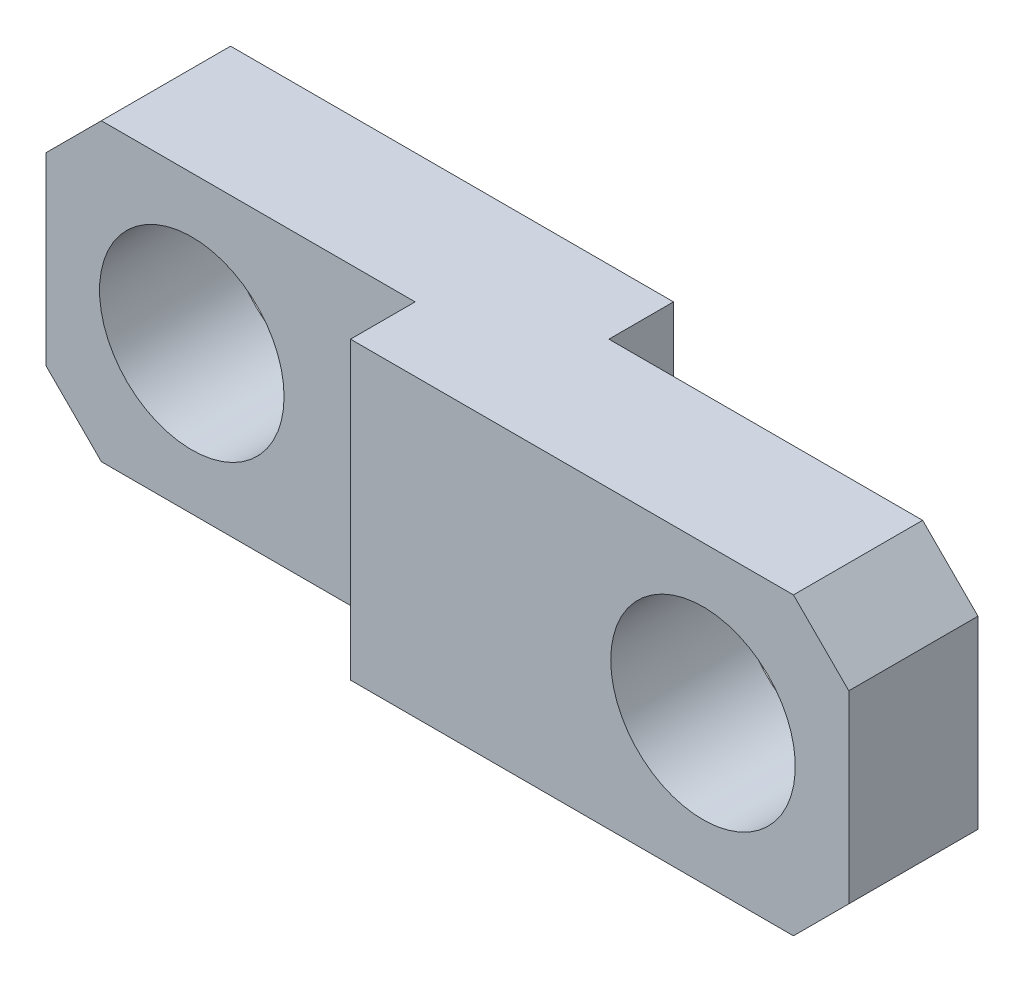
ISO-10303-21;
HEADER;
FILE_DESCRIPTION(('STEP AP214'),'2;1');
FILE_NAME('part.step','',(''),(''),'','','');
FILE_SCHEMA(('AUTOMOTIVE_DESIGN { 1 0 10303 214 1 1 1 1 }'));
ENDSEC;
DATA;
#1=APPLICATION_CONTEXT('core data for automotive mechanical design processes');
#2=APPLICATION_PROTOCOL_DEFINITION('international standard','automotive_design',2000,#1);
#3=PRODUCT_CONTEXT('',#1,'mechanical');
#4=PRODUCT('Part','Part','',(#3));
#5=PRODUCT_RELATED_PRODUCT_CATEGORY('part','',(#4));
#6=PRODUCT_DEFINITION_FORMATION('','',#4);
#7=PRODUCT_DEFINITION_CONTEXT('part definition',#1,'design');
#8=PRODUCT_DEFINITION('design','',#6,#7);
#9=PRODUCT_DEFINITION_SHAPE('','',#8);
#10=(LENGTH_UNIT() NAMED_UNIT(*) SI_UNIT(.MILLI.,.METRE.));
#11=(NAMED_UNIT(*) PLANE_ANGLE_UNIT() SI_UNIT($,.RADIAN.));
#12=(NAMED_UNIT(*) SI_UNIT($,.STERADIAN.) SOLID_ANGLE_UNIT());
#13=UNCERTAINTY_MEASURE_WITH_UNIT(LENGTH_MEASURE(1.E-05),#10,'distance_accuracy_value','');
#14=(GEOMETRIC_REPRESENTATION_CONTEXT(3) GLOBAL_UNCERTAINTY_ASSIGNED_CONTEXT((#13)) GLOBAL_UNIT_ASSIGNED_CONTEXT((#10,
#11,#12)) REPRESENTATION_CONTEXT('',''));
#15=CARTESIAN_POINT('',(0.,0.,0.));
#16=DIRECTION('',(0.,0.,1.));
#17=DIRECTION('',(1.,0.,0.));
#18=AXIS2_PLACEMENT_3D('',#15,#16,#17);
#19=CARTESIAN_POINT('',(19.55,4.,2.625));
#20=DIRECTION('',(-1.,0.,0.));
#21=DIRECTION('',(0.,-1.,0.));
#22=AXIS2_PLACEMENT_3D('',#19,#20,#21);
#23=PLANE('',#22);
#24=DIRECTION('',(0.,1.,0.));
#25=VECTOR('',#24,1.);
#26=CARTESIAN_POINT('',(19.55,4.,2.625));
#27=LINE('',#26,#25);
#28=CARTESIAN_POINT('',(19.55,-2.49999999999998,2.625));
#29=VERTEX_POINT('',#28);
#30=CARTESIAN_POINT('',(19.55,2.49999999999999,2.625));
#31=VERTEX_POINT('',#30);
#32=EDGE_CURVE('E203',#29,#31,#27,.T.);
#33=ORIENTED_EDGE('',*,*,#32,.F.);
#34=DIRECTION('',(0.,0.,-1.));
#35=VECTOR('',#34,1.);
#36=CARTESIAN_POINT('',(19.55,-2.49999999999999,2.625));
#37=LINE('',#36,#35);
#38=CARTESIAN_POINT('',(19.55,-2.49999999999999,-0.875));
#39=VERTEX_POINT('',#38);
#40=EDGE_CURVE('E214',#29,#39,#37,.T.);
#41=ORIENTED_EDGE('',*,*,#40,.T.);
#42=DIRECTION('',(0.,-1.,0.));
#43=VECTOR('',#42,1.);
#44=CARTESIAN_POINT('',(19.55,4.,-0.875));
#45=LINE('',#44,#43);
#46=CARTESIAN_POINT('',(19.55,2.49999999999999,-0.875));
#47=VERTEX_POINT('',#46);
#48=EDGE_CURVE('E160',#47,#39,#45,.T.);
#49=ORIENTED_EDGE('',*,*,#48,.F.);
#50=DIRECTION('',(0.,0.,1.));
#51=VECTOR('',#50,1.);
#52=CARTESIAN_POINT('',(19.55,2.49999999999999,2.625));
#53=LINE('',#52,#51);
#54=EDGE_CURVE('E208',#47,#31,#53,.T.);
#55=ORIENTED_EDGE('',*,*,#54,.T.);
#56=EDGE_LOOP('',(#33,#41,#49,#55));
#57=FACE_BOUND('',#56,.T.);
#58=ADVANCED_FACE('F32',(#57),#23,.F.);
#59=CARTESIAN_POINT('',(15.6,0.,2.625));
#60=DIRECTION('',(0.,0.,-1.));
#61=DIRECTION('',(-1.,0.,0.));
#62=AXIS2_PLACEMENT_3D('',#59,#60,#61);
#63=CYLINDRICAL_SURFACE('',#62,2.5);
#64=CARTESIAN_POINT('',(15.6,0.,2.625));
#65=DIRECTION('',(0.,0.,1.));
#66=DIRECTION('',(-1.,0.,0.));
#67=AXIS2_PLACEMENT_3D('',#64,#65,#66);
#68=CIRCLE('',#67,2.5);
#69=CARTESIAN_POINT('',(13.1,0.,2.625));
#70=VERTEX_POINT('',#69);
#71=EDGE_CURVE('E191',#70,#70,#68,.T.);
#72=ORIENTED_EDGE('',*,*,#71,.T.);
#73=EDGE_LOOP('',(#72));
#74=FACE_BOUND('',#73,.T.);
#75=CARTESIAN_POINT('',(15.6,0.,-0.875));
#76=DIRECTION('',(0.,0.,-1.));
#77=DIRECTION('',(-1.,0.,0.));
#78=AXIS2_PLACEMENT_3D('',#75,#76,#77);
#79=CIRCLE('',#78,2.5);
#80=CARTESIAN_POINT('',(13.1,0.,-0.875));
#81=VERTEX_POINT('',#80);
#82=EDGE_CURVE('E170',#81,#81,#79,.T.);
#83=ORIENTED_EDGE('',*,*,#82,.T.);
#84=EDGE_LOOP('',(#83));
#85=FACE_BOUND('',#84,.T.);
#86=ADVANCED_FACE('F293',(#74,#85),#63,.F.);
#87=CARTESIAN_POINT('',(-3.95,4.,2.625));
#88=DIRECTION('',(1.,0.,0.));
#89=DIRECTION('',(0.,0.,-1.));
#90=AXIS2_PLACEMENT_3D('',#87,#88,#89);
#91=PLANE('',#90);
#92=DIRECTION('',(0.,-1.,0.));
#93=VECTOR('',#92,1.);
#94=CARTESIAN_POINT('',(-3.95,4.,0.875));
#95=LINE('',#94,#93);
#96=CARTESIAN_POINT('',(-3.95,2.49999999999999,0.875));
#97=VERTEX_POINT('',#96);
#98=CARTESIAN_POINT('',(-3.95,-2.49999999999999,0.875));
#99=VERTEX_POINT('',#98);
#100=EDGE_CURVE('E182',#97,#99,#95,.T.);
#101=ORIENTED_EDGE('',*,*,#100,.F.);
#102=DIRECTION('',(0.,0.,-1.));
#103=VECTOR('',#102,1.);
#104=CARTESIAN_POINT('',(-3.95,2.49999999999999,2.625));
#105=LINE('',#104,#103);
#106=CARTESIAN_POINT('',(-3.95,2.49999999999999,-2.625));
#107=VERTEX_POINT('',#106);
#108=EDGE_CURVE('E235',#97,#107,#105,.T.);
#109=ORIENTED_EDGE('',*,*,#108,.T.);
#110=DIRECTION('',(0.,-1.,0.));
#111=VECTOR('',#110,1.);
#112=CARTESIAN_POINT('',(-3.95,4.,-2.625));
#113=LINE('',#112,#111);
#114=CARTESIAN_POINT('',(-3.95,-2.49999999999999,-2.625));
#115=VERTEX_POINT('',#114);
#116=EDGE_CURVE('E138',#107,#115,#113,.T.);
#117=ORIENTED_EDGE('',*,*,#116,.T.);
#118=DIRECTION('',(0.,0.,1.));
#119=VECTOR('',#118,1.);
#120=CARTESIAN_POINT('',(-3.95,-2.49999999999999,2.625));
#121=LINE('',#120,#119);
#122=EDGE_CURVE('E233',#115,#99,#121,.T.);
#123=ORIENTED_EDGE('',*,*,#122,.T.);
#124=EDGE_LOOP('',(#101,#109,#117,#123));
#125=FACE_BOUND('',#124,.T.);
#126=ADVANCED_FACE('F34',(#125),#91,.F.);
#127=CARTESIAN_POINT('',(0.,0.,2.625));
#128=DIRECTION('',(0.,0.,-1.));
#129=DIRECTION('',(-1.,0.,0.));
#130=AXIS2_PLACEMENT_3D('',#127,#128,#129);
#131=CYLINDRICAL_SURFACE('',#130,2.5);
#132=CARTESIAN_POINT('',(0.,0.,-2.625));
#133=DIRECTION('',(0.,0.,1.));
#134=DIRECTION('',(1.,0.,0.));
#135=AXIS2_PLACEMENT_3D('',#132,#133,#134);
#136=CIRCLE('',#135,2.5);
#137=CARTESIAN_POINT('',(2.5,0.,-2.625));
#138=VERTEX_POINT('',#137);
#139=EDGE_CURVE('E194',#138,#138,#136,.T.);
#140=ORIENTED_EDGE('',*,*,#139,.F.);
#141=EDGE_LOOP('',(#140));
#142=FACE_BOUND('',#141,.T.);
#143=CARTESIAN_POINT('',(0.,0.,0.875));
#144=DIRECTION('',(0.,0.,1.));
#145=DIRECTION('',(1.,0.,0.));
#146=AXIS2_PLACEMENT_3D('',#143,#144,#145);
#147=CIRCLE('',#146,2.5);
#148=CARTESIAN_POINT('',(2.5,0.,0.875));
#149=VERTEX_POINT('',#148);
#150=EDGE_CURVE('E189',#149,#149,#147,.T.);
#151=ORIENTED_EDGE('',*,*,#150,.T.);
#152=EDGE_LOOP('',(#151));
#153=FACE_BOUND('',#152,.T.);
#154=ADVANCED_FACE('F312',(#142,#153),#131,.F.);
#155=CARTESIAN_POINT('',(-3.95,-4.,2.625));
#156=DIRECTION('',(0.,0.,1.));
#157=DIRECTION('',(1.,0.,0.));
#158=AXIS2_PLACEMENT_3D('',#155,#156,#157);
#159=PLANE('',#158);
#160=DIRECTION('',(1.,0.,0.));
#161=VECTOR('',#160,1.);
#162=CARTESIAN_POINT('',(-3.95,-4.,2.625));
#163=LINE('',#162,#161);
#164=CARTESIAN_POINT('',(6.05,-4.,2.625));
#165=VERTEX_POINT('',#164);
#166=CARTESIAN_POINT('',(18.05,-4.,2.625));
#167=VERTEX_POINT('',#166);
#168=EDGE_CURVE('E200',#165,#167,#163,.T.);
#169=ORIENTED_EDGE('',*,*,#168,.T.);
#170=DIRECTION('',(-0.707106781186553,-0.707106781186542,0.));
#171=VECTOR('',#170,1.);
#172=CARTESIAN_POINT('',(7.04999999999982,-15.,2.625));
#173=LINE('',#172,#171);
#174=EDGE_CURVE('E226',#167,#29,#173,.F.);
#175=ORIENTED_EDGE('',*,*,#174,.T.);
#176=ORIENTED_EDGE('',*,*,#32,.T.);
#177=DIRECTION('',(0.707106781186552,-0.707106781186543,0.));
#178=VECTOR('',#177,1.);
#179=CARTESIAN_POINT('',(11.0499999999998,11.,2.625));
#180=LINE('',#179,#178);
#181=CARTESIAN_POINT('',(18.05,4.,2.625));
#182=VERTEX_POINT('',#181);
#183=EDGE_CURVE('E224',#31,#182,#180,.F.);
#184=ORIENTED_EDGE('',*,*,#183,.T.);
#185=DIRECTION('',(-1.,0.,0.));
#186=VECTOR('',#185,1.);
#187=CARTESIAN_POINT('',(-3.95,4.,2.625));
#188=LINE('',#187,#186);
#189=CARTESIAN_POINT('',(6.05,4.,2.625));
#190=VERTEX_POINT('',#189);
#191=EDGE_CURVE('E206',#182,#190,#188,.T.);
#192=ORIENTED_EDGE('',*,*,#191,.T.);
#193=DIRECTION('',(0.,1.,0.));
#194=VECTOR('',#193,1.);
#195=CARTESIAN_POINT('',(6.05,-4.,2.625));
#196=LINE('',#195,#194);
#197=EDGE_CURVE('E172',#165,#190,#196,.T.);
#198=ORIENTED_EDGE('',*,*,#197,.F.);
#199=EDGE_LOOP('',(#169,#175,#176,#184,#192,#198));
#200=FACE_BOUND('',#199,.T.);
#201=ORIENTED_EDGE('',*,*,#71,.F.);
#202=EDGE_LOOP('',(#201));
#203=FACE_BOUND('',#202,.T.);
#204=ADVANCED_FACE('F263',(#200,#203),#159,.T.);
#205=CARTESIAN_POINT('',(-3.95,-4.,-2.625));
#206=DIRECTION('',(0.,0.,1.));
#207=DIRECTION('',(1.,0.,0.));
#208=AXIS2_PLACEMENT_3D('',#205,#206,#207);
#209=PLANE('',#208);
#210=ORIENTED_EDGE('',*,*,#139,.T.);
#211=EDGE_LOOP('',(#210));
#212=FACE_BOUND('',#211,.T.);
#213=ORIENTED_EDGE('',*,*,#116,.F.);
#214=DIRECTION('',(-0.707106781186551,-0.707106781186544,0.));
#215=VECTOR('',#214,1.);
#216=CARTESIAN_POINT('',(-3.95,2.49999999999999,-2.625));
#217=LINE('',#216,#215);
#218=CARTESIAN_POINT('',(-2.44999999999998,4.,-2.625));
#219=VERTEX_POINT('',#218);
#220=EDGE_CURVE('E55',#107,#219,#217,.F.);
#221=ORIENTED_EDGE('',*,*,#220,.T.);
#222=DIRECTION('',(-1.,0.,0.));
#223=VECTOR('',#222,1.);
#224=CARTESIAN_POINT('',(-3.95,4.,-2.625));
#225=LINE('',#224,#223);
#226=CARTESIAN_POINT('',(9.55,4.,-2.625));
#227=VERTEX_POINT('',#226);
#228=EDGE_CURVE('E137',#227,#219,#225,.T.);
#229=ORIENTED_EDGE('',*,*,#228,.F.);
#230=DIRECTION('',(0.,1.,0.));
#231=VECTOR('',#230,1.);
#232=CARTESIAN_POINT('',(9.55,4.,-2.625));
#233=LINE('',#232,#231);
#234=CARTESIAN_POINT('',(9.55,-2.,-2.625));
#235=VERTEX_POINT('',#234);
#236=EDGE_CURVE('E153',#235,#227,#233,.T.);
#237=ORIENTED_EDGE('',*,*,#236,.F.);
#238=DIRECTION('',(0.866025403784441,0.499999999999995,0.));
#239=VECTOR('',#238,1.);
#240=CARTESIAN_POINT('',(9.55,-2.,-2.625));
#241=LINE('',#240,#239);
#242=CARTESIAN_POINT('',(6.0858983848622,-4.,-2.625));
#243=VERTEX_POINT('',#242);
#244=EDGE_CURVE('E144',#243,#235,#241,.T.);
#245=ORIENTED_EDGE('',*,*,#244,.F.);
#246=DIRECTION('',(1.,0.,0.));
#247=VECTOR('',#246,1.);
#248=CARTESIAN_POINT('',(-3.95,-4.,-2.625));
#249=LINE('',#248,#247);
#250=CARTESIAN_POINT('',(-2.44999999999998,-4.,-2.625));
#251=VERTEX_POINT('',#250);
#252=EDGE_CURVE('E128',#251,#243,#249,.T.);
#253=ORIENTED_EDGE('',*,*,#252,.F.);
#254=DIRECTION('',(0.707106781186551,-0.707106781186544,0.));
#255=VECTOR('',#254,1.);
#256=CARTESIAN_POINT('',(-2.44999999999998,-4.,-2.625));
#257=LINE('',#256,#255);
#258=EDGE_CURVE('E47',#251,#115,#257,.F.);
#259=ORIENTED_EDGE('',*,*,#258,.T.);
#260=EDGE_LOOP('',(#213,#221,#229,#237,#245,#253,#259));
#261=FACE_BOUND('',#260,.T.);
#262=ADVANCED_FACE('F151',(#212,#261),#209,.F.);
#263=CARTESIAN_POINT('',(-3.95,-4.,2.625));
#264=DIRECTION('',(0.,1.,0.));
#265=DIRECTION('',(-1.,0.,0.));
#266=AXIS2_PLACEMENT_3D('',#263,#264,#265);
#267=PLANE('',#266);
#268=DIRECTION('',(-1.,0.,0.));
#269=VECTOR('',#268,1.);
#270=CARTESIAN_POINT('',(19.55,-4.,-0.875));
#271=LINE('',#270,#269);
#272=CARTESIAN_POINT('',(18.05,-4.,-0.875));
#273=VERTEX_POINT('',#272);
#274=CARTESIAN_POINT('',(6.0858983848622,-4.,-0.875));
#275=VERTEX_POINT('',#274);
#276=EDGE_CURVE('E163',#273,#275,#271,.T.);
#277=ORIENTED_EDGE('',*,*,#276,.F.);
#278=DIRECTION('',(0.,0.,1.));
#279=VECTOR('',#278,1.);
#280=CARTESIAN_POINT('',(18.05,-4.,2.625));
#281=LINE('',#280,#279);
#282=EDGE_CURVE('E222',#273,#167,#281,.T.);
#283=ORIENTED_EDGE('',*,*,#282,.T.);
#284=ORIENTED_EDGE('',*,*,#168,.F.);
#285=DIRECTION('',(0.,0.,1.));
#286=VECTOR('',#285,1.);
#287=CARTESIAN_POINT('',(6.05,-4.,0.875));
#288=LINE('',#287,#286);
#289=CARTESIAN_POINT('',(6.05,-4.,0.875));
#290=VERTEX_POINT('',#289);
#291=EDGE_CURVE('E185',#290,#165,#288,.T.);
#292=ORIENTED_EDGE('',*,*,#291,.F.);
#293=DIRECTION('',(1.,0.,0.));
#294=VECTOR('',#293,1.);
#295=CARTESIAN_POINT('',(-3.95,-4.,0.875));
#296=LINE('',#295,#294);
#297=CARTESIAN_POINT('',(-2.44999999999998,-4.,0.875));
#298=VERTEX_POINT('',#297);
#299=EDGE_CURVE('E175',#298,#290,#296,.T.);
#300=ORIENTED_EDGE('',*,*,#299,.F.);
#301=DIRECTION('',(0.,0.,-1.));
#302=VECTOR('',#301,1.);
#303=CARTESIAN_POINT('',(-2.44999999999998,-4.,2.625));
#304=LINE('',#303,#302);
#305=EDGE_CURVE('E135',#298,#251,#304,.T.);
#306=ORIENTED_EDGE('',*,*,#305,.T.);
#307=ORIENTED_EDGE('',*,*,#252,.T.);
#308=DIRECTION('',(0.,0.,-1.));
#309=VECTOR('',#308,1.);
#310=CARTESIAN_POINT('',(6.0858983848622,-4.,-0.875));
#311=LINE('',#310,#309);
#312=EDGE_CURVE('E132',#275,#243,#311,.T.);
#313=ORIENTED_EDGE('',*,*,#312,.F.);
#314=EDGE_LOOP('',(#277,#283,#284,#292,#300,#306,#307,#313));
#315=FACE_BOUND('',#314,.T.);
#316=ADVANCED_FACE('F131',(#315),#267,.F.);
#317=CARTESIAN_POINT('',(-3.95,4.,2.625));
#318=DIRECTION('',(0.,-1.,0.));
#319=DIRECTION('',(1.,0.,0.));
#320=AXIS2_PLACEMENT_3D('',#317,#318,#319);
#321=PLANE('',#320);
#322=ORIENTED_EDGE('',*,*,#191,.F.);
#323=DIRECTION('',(0.,0.,-1.));
#324=VECTOR('',#323,1.);
#325=CARTESIAN_POINT('',(18.05,4.,2.625));
#326=LINE('',#325,#324);
#327=CARTESIAN_POINT('',(18.05,4.,-0.875));
#328=VERTEX_POINT('',#327);
#329=EDGE_CURVE('E230',#182,#328,#326,.T.);
#330=ORIENTED_EDGE('',*,*,#329,.T.);
#331=DIRECTION('',(1.,0.,0.));
#332=VECTOR('',#331,1.);
#333=CARTESIAN_POINT('',(9.55,4.,-0.875));
#334=LINE('',#333,#332);
#335=CARTESIAN_POINT('',(9.55,4.,-0.875));
#336=VERTEX_POINT('',#335);
#337=EDGE_CURVE('E155',#336,#328,#334,.T.);
#338=ORIENTED_EDGE('',*,*,#337,.F.);
#339=DIRECTION('',(0.,0.,-1.));
#340=VECTOR('',#339,1.);
#341=CARTESIAN_POINT('',(9.55,4.,-0.875));
#342=LINE('',#341,#340);
#343=EDGE_CURVE('E167',#336,#227,#342,.T.);
#344=ORIENTED_EDGE('',*,*,#343,.T.);
#345=ORIENTED_EDGE('',*,*,#228,.T.);
#346=DIRECTION('',(0.,0.,1.));
#347=VECTOR('',#346,1.);
#348=CARTESIAN_POINT('',(-2.44999999999998,4.,2.625));
#349=LINE('',#348,#347);
#350=CARTESIAN_POINT('',(-2.44999999999998,4.,0.875));
#351=VERTEX_POINT('',#350);
#352=EDGE_CURVE('E228',#219,#351,#349,.T.);
#353=ORIENTED_EDGE('',*,*,#352,.T.);
#354=DIRECTION('',(-1.,0.,0.));
#355=VECTOR('',#354,1.);
#356=CARTESIAN_POINT('',(6.05,4.,0.875));
#357=LINE('',#356,#355);
#358=CARTESIAN_POINT('',(6.05,4.,0.875));
#359=VERTEX_POINT('',#358);
#360=EDGE_CURVE('E179',#359,#351,#357,.T.);
#361=ORIENTED_EDGE('',*,*,#360,.F.);
#362=DIRECTION('',(0.,0.,1.));
#363=VECTOR('',#362,1.);
#364=CARTESIAN_POINT('',(6.05,4.,0.875));
#365=LINE('',#364,#363);
#366=EDGE_CURVE('E186',#359,#190,#365,.T.);
#367=ORIENTED_EDGE('',*,*,#366,.T.);
#368=EDGE_LOOP('',(#322,#330,#338,#344,#345,#353,#361,#367));
#369=FACE_BOUND('',#368,.T.);
#370=ADVANCED_FACE('F251',(#369),#321,.F.);
#371=CARTESIAN_POINT('',(6.05,-4.,0.875));
#372=DIRECTION('',(1.,0.,0.));
#373=DIRECTION('',(0.,0.,-1.));
#374=AXIS2_PLACEMENT_3D('',#371,#372,#373);
#375=PLANE('',#374);
#376=ORIENTED_EDGE('',*,*,#197,.T.);
#377=ORIENTED_EDGE('',*,*,#366,.F.);
#378=DIRECTION('',(0.,1.,0.));
#379=VECTOR('',#378,1.);
#380=CARTESIAN_POINT('',(6.05,-4.,0.875));
#381=LINE('',#380,#379);
#382=EDGE_CURVE('E177',#290,#359,#381,.T.);
#383=ORIENTED_EDGE('',*,*,#382,.F.);
#384=ORIENTED_EDGE('',*,*,#291,.T.);
#385=EDGE_LOOP('',(#376,#377,#383,#384));
#386=FACE_BOUND('',#385,.T.);
#387=ADVANCED_FACE('F260',(#386),#375,.F.);
#388=CARTESIAN_POINT('',(6.05,-4.,0.875));
#389=DIRECTION('',(0.,0.,1.));
#390=DIRECTION('',(1.,0.,0.));
#391=AXIS2_PLACEMENT_3D('',#388,#389,#390);
#392=PLANE('',#391);
#393=ORIENTED_EDGE('',*,*,#150,.F.);
#394=EDGE_LOOP('',(#393));
#395=FACE_BOUND('',#394,.T.);
#396=ORIENTED_EDGE('',*,*,#360,.T.);
#397=DIRECTION('',(0.707106781186551,0.707106781186544,0.));
#398=VECTOR('',#397,1.);
#399=CARTESIAN_POINT('',(-2.19999999999995,4.25000000000003,0.875));
#400=LINE('',#399,#398);
#401=EDGE_CURVE('E11',#351,#97,#400,.F.);
#402=ORIENTED_EDGE('',*,*,#401,.T.);
#403=ORIENTED_EDGE('',*,*,#100,.T.);
#404=DIRECTION('',(-0.707106781186551,0.707106781186544,0.));
#405=VECTOR('',#404,1.);
#406=CARTESIAN_POINT('',(1.80000000000006,-8.24999999999999,0.875));
#407=LINE('',#406,#405);
#408=EDGE_CURVE('E40',#99,#298,#407,.F.);
#409=ORIENTED_EDGE('',*,*,#408,.T.);
#410=ORIENTED_EDGE('',*,*,#299,.T.);
#411=ORIENTED_EDGE('',*,*,#382,.T.);
#412=EDGE_LOOP('',(#396,#402,#403,#409,#410,#411));
#413=FACE_BOUND('',#412,.T.);
#414=ADVANCED_FACE('F240',(#395,#413),#392,.T.);
#415=CARTESIAN_POINT('',(9.55,4.,-0.875));
#416=DIRECTION('',(-1.,0.,0.));
#417=DIRECTION('',(0.,-1.,0.));
#418=AXIS2_PLACEMENT_3D('',#415,#416,#417);
#419=PLANE('',#418);
#420=ORIENTED_EDGE('',*,*,#236,.T.);
#421=ORIENTED_EDGE('',*,*,#343,.F.);
#422=DIRECTION('',(0.,1.,0.));
#423=VECTOR('',#422,1.);
#424=CARTESIAN_POINT('',(9.55,4.,-0.875));
#425=LINE('',#424,#423);
#426=CARTESIAN_POINT('',(9.55,-2.,-0.875));
#427=VERTEX_POINT('',#426);
#428=EDGE_CURVE('E149',#427,#336,#425,.T.);
#429=ORIENTED_EDGE('',*,*,#428,.F.);
#430=DIRECTION('',(0.,0.,-1.));
#431=VECTOR('',#430,1.);
#432=CARTESIAN_POINT('',(9.55,-2.,-0.875));
#433=LINE('',#432,#431);
#434=EDGE_CURVE('E148',#427,#235,#433,.T.);
#435=ORIENTED_EDGE('',*,*,#434,.T.);
#436=EDGE_LOOP('',(#420,#421,#429,#435));
#437=FACE_BOUND('',#436,.T.);
#438=ADVANCED_FACE('F281',(#437),#419,.F.);
#439=CARTESIAN_POINT('',(9.55,-2.,-0.875));
#440=DIRECTION('',(-0.499999999999995,0.866025403784441,0.));
#441=DIRECTION('',(-0.866025403784441,-0.499999999999995,0.));
#442=AXIS2_PLACEMENT_3D('',#439,#440,#441);
#443=PLANE('',#442);
#444=ORIENTED_EDGE('',*,*,#244,.T.);
#445=ORIENTED_EDGE('',*,*,#434,.F.);
#446=DIRECTION('',(0.866025403784441,0.499999999999995,0.));
#447=VECTOR('',#446,1.);
#448=CARTESIAN_POINT('',(9.55,-2.,-0.875));
#449=LINE('',#448,#447);
#450=EDGE_CURVE('E147',#275,#427,#449,.T.);
#451=ORIENTED_EDGE('',*,*,#450,.F.);
#452=ORIENTED_EDGE('',*,*,#312,.T.);
#453=EDGE_LOOP('',(#444,#445,#451,#452));
#454=FACE_BOUND('',#453,.T.);
#455=ADVANCED_FACE('F143',(#454),#443,.F.);
#456=CARTESIAN_POINT('',(19.55,4.,-0.875));
#457=DIRECTION('',(0.,0.,-1.));
#458=DIRECTION('',(-1.,0.,0.));
#459=AXIS2_PLACEMENT_3D('',#456,#457,#458);
#460=PLANE('',#459);
#461=ORIENTED_EDGE('',*,*,#82,.F.);
#462=EDGE_LOOP('',(#461));
#463=FACE_BOUND('',#462,.T.);
#464=ORIENTED_EDGE('',*,*,#48,.T.);
#465=DIRECTION('',(0.707106781186553,0.707106781186542,0.));
#466=VECTOR('',#465,1.);
#467=CARTESIAN_POINT('',(22.8,0.749999999999957,-0.875));
#468=LINE('',#467,#466);
#469=EDGE_CURVE('E219',#39,#273,#468,.F.);
#470=ORIENTED_EDGE('',*,*,#469,.T.);
#471=ORIENTED_EDGE('',*,*,#276,.T.);
#472=ORIENTED_EDGE('',*,*,#450,.T.);
#473=ORIENTED_EDGE('',*,*,#428,.T.);
#474=ORIENTED_EDGE('',*,*,#337,.T.);
#475=DIRECTION('',(-0.707106781186552,0.707106781186543,0.));
#476=VECTOR('',#475,1.);
#477=CARTESIAN_POINT('',(18.8,3.24999999999999,-0.875));
#478=LINE('',#477,#476);
#479=EDGE_CURVE('E217',#328,#47,#478,.F.);
#480=ORIENTED_EDGE('',*,*,#479,.T.);
#481=EDGE_LOOP('',(#464,#470,#471,#472,#473,#474,#480));
#482=FACE_BOUND('',#481,.T.);
#483=ADVANCED_FACE('F278',(#463,#482),#460,.T.);
#484=CARTESIAN_POINT('',(19.55,-2.49999999999999,2.625));
#485=DIRECTION('',(-0.707106781186542,0.707106781186553,0.));
#486=DIRECTION('',(-0.707106781186553,-0.707106781186542,0.));
#487=AXIS2_PLACEMENT_3D('',#484,#485,#486);
#488=PLANE('',#487);
#489=ORIENTED_EDGE('',*,*,#174,.F.);
#490=ORIENTED_EDGE('',*,*,#282,.F.);
#491=ORIENTED_EDGE('',*,*,#469,.F.);
#492=ORIENTED_EDGE('',*,*,#40,.F.);
#493=EDGE_LOOP('',(#489,#490,#491,#492));
#494=FACE_BOUND('',#493,.T.);
#495=ADVANCED_FACE('F268',(#494),#488,.F.);
#496=CARTESIAN_POINT('',(18.05,4.,2.625));
#497=DIRECTION('',(-0.707106781186543,-0.707106781186552,0.));
#498=DIRECTION('',(0.707106781186552,-0.707106781186543,0.));
#499=AXIS2_PLACEMENT_3D('',#496,#497,#498);
#500=PLANE('',#499);
#501=ORIENTED_EDGE('',*,*,#183,.F.);
#502=ORIENTED_EDGE('',*,*,#54,.F.);
#503=ORIENTED_EDGE('',*,*,#479,.F.);
#504=ORIENTED_EDGE('',*,*,#329,.F.);
#505=EDGE_LOOP('',(#501,#502,#503,#504));
#506=FACE_BOUND('',#505,.T.);
#507=ADVANCED_FACE('F276',(#506),#500,.F.);
#508=CARTESIAN_POINT('',(-3.95,2.49999999999999,2.625));
#509=DIRECTION('',(0.707106781186544,-0.707106781186551,0.));
#510=DIRECTION('',(0.707106781186551,0.707106781186544,0.));
#511=AXIS2_PLACEMENT_3D('',#508,#509,#510);
#512=PLANE('',#511);
#513=ORIENTED_EDGE('',*,*,#401,.F.);
#514=ORIENTED_EDGE('',*,*,#352,.F.);
#515=ORIENTED_EDGE('',*,*,#220,.F.);
#516=ORIENTED_EDGE('',*,*,#108,.F.);
#517=EDGE_LOOP('',(#513,#514,#515,#516));
#518=FACE_BOUND('',#517,.T.);
#519=ADVANCED_FACE('F256',(#518),#512,.F.);
#520=CARTESIAN_POINT('',(-2.44999999999998,-4.,2.625));
#521=DIRECTION('',(0.707106781186544,0.707106781186551,0.));
#522=DIRECTION('',(-0.707106781186551,0.707106781186544,0.));
#523=AXIS2_PLACEMENT_3D('',#520,#521,#522);
#524=PLANE('',#523);
#525=ORIENTED_EDGE('',*,*,#408,.F.);
#526=ORIENTED_EDGE('',*,*,#122,.F.);
#527=ORIENTED_EDGE('',*,*,#258,.F.);
#528=ORIENTED_EDGE('',*,*,#305,.F.);
#529=EDGE_LOOP('',(#525,#526,#527,#528));
#530=FACE_BOUND('',#529,.T.);
#531=ADVANCED_FACE('F247',(#530),#524,.F.);
#532=CLOSED_SHELL('',(#58,#86,#126,#154,#204,#262,#316,#370,#387,#414,#438,#455,#483,#495,#507,
#519,#531));
#533=MANIFOLD_SOLID_BREP('B2',#532);
#534=ADVANCED_BREP_SHAPE_REPRESENTATION('',(#18,#533),#14);
#535=SHAPE_DEFINITION_REPRESENTATION(#9,#534);
ENDSEC;
END-ISO-10303-21;
